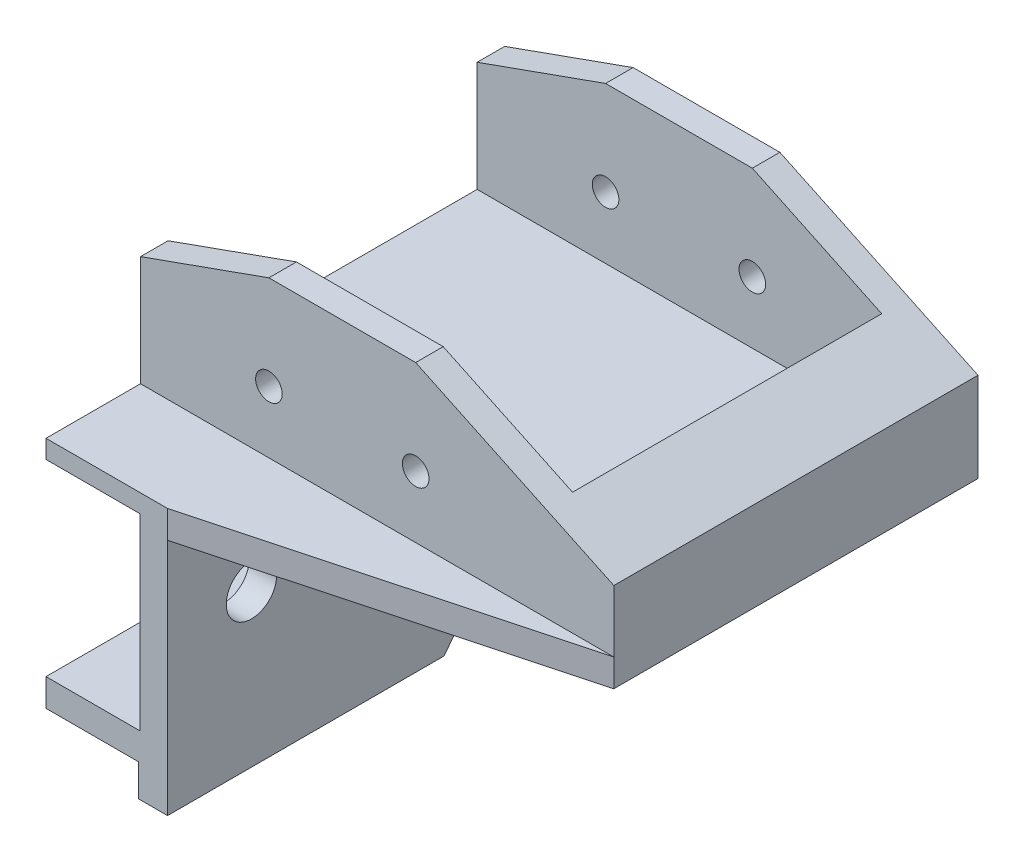
ISO-10303-21;
HEADER;
FILE_DESCRIPTION(('STEP AP214'),'2;1');
FILE_NAME('part.step','',(''),(''),'','','');
FILE_SCHEMA(('AUTOMOTIVE_DESIGN { 1 0 10303 214 1 1 1 1 }'));
ENDSEC;
DATA;
#1=APPLICATION_CONTEXT('core data for automotive mechanical design processes');
#2=APPLICATION_PROTOCOL_DEFINITION('international standard','automotive_design',2000,#1);
#3=PRODUCT_CONTEXT('',#1,'mechanical');
#4=PRODUCT('Part','Part','',(#3));
#5=PRODUCT_RELATED_PRODUCT_CATEGORY('part','',(#4));
#6=PRODUCT_DEFINITION_FORMATION('','',#4);
#7=PRODUCT_DEFINITION_CONTEXT('part definition',#1,'design');
#8=PRODUCT_DEFINITION('design','',#6,#7);
#9=PRODUCT_DEFINITION_SHAPE('','',#8);
#10=(LENGTH_UNIT() NAMED_UNIT(*) SI_UNIT(.MILLI.,.METRE.));
#11=(NAMED_UNIT(*) PLANE_ANGLE_UNIT() SI_UNIT($,.RADIAN.));
#12=(NAMED_UNIT(*) SI_UNIT($,.STERADIAN.) SOLID_ANGLE_UNIT());
#13=UNCERTAINTY_MEASURE_WITH_UNIT(LENGTH_MEASURE(1.E-05),#10,'distance_accuracy_value','');
#14=(GEOMETRIC_REPRESENTATION_CONTEXT(3) GLOBAL_UNCERTAINTY_ASSIGNED_CONTEXT((#13)) GLOBAL_UNIT_ASSIGNED_CONTEXT((#10,
#11,#12)) REPRESENTATION_CONTEXT('',''));
#15=CARTESIAN_POINT('',(0.,0.,0.));
#16=DIRECTION('',(0.,0.,1.));
#17=DIRECTION('',(1.,0.,0.));
#18=AXIS2_PLACEMENT_3D('',#15,#16,#17);
#19=CARTESIAN_POINT('',(-103.2,0.,39.7));
#20=DIRECTION('',(0.,0.,-1.));
#21=DIRECTION('',(1.,0.,0.));
#22=AXIS2_PLACEMENT_3D('',#19,#20,#21);
#23=PLANE('',#22);
#24=CARTESIAN_POINT('',(-21.6,9.75,39.7));
#25=DIRECTION('',(0.,0.,1.));
#26=DIRECTION('',(1.,0.,0.));
#27=AXIS2_PLACEMENT_3D('',#24,#25,#26);
#28=CIRCLE('',#27,1.44999999999999);
#29=CARTESIAN_POINT('',(-20.15,9.75,39.7));
#30=VERTEX_POINT('',#29);
#31=EDGE_CURVE('E306',#30,#30,#28,.T.);
#32=ORIENTED_EDGE('',*,*,#31,.F.);
#33=EDGE_LOOP('',(#32));
#34=FACE_BOUND('',#33,.T.);
#35=CARTESIAN_POINT('',(-37.6,9.75,39.7));
#36=DIRECTION('',(0.,0.,1.));
#37=DIRECTION('',(1.,0.,0.));
#38=AXIS2_PLACEMENT_3D('',#35,#36,#37);
#39=CIRCLE('',#38,1.44999999999999);
#40=CARTESIAN_POINT('',(-36.15,9.75,39.7));
#41=VERTEX_POINT('',#40);
#42=EDGE_CURVE('E293',#41,#41,#39,.T.);
#43=ORIENTED_EDGE('',*,*,#42,.F.);
#44=EDGE_LOOP('',(#43));
#45=FACE_BOUND('',#44,.T.);
#46=DIRECTION('',(1.,0.,0.));
#47=VECTOR('',#46,1.);
#48=CARTESIAN_POINT('',(-103.2,2.99999999999999,39.7));
#49=LINE('',#48,#47);
#50=CARTESIAN_POINT('',(-51.6,2.99999999999999,39.7));
#51=VERTEX_POINT('',#50);
#52=CARTESIAN_POINT('',(0.,3.00000000000001,39.7));
#53=VERTEX_POINT('',#52);
#54=EDGE_CURVE('E368',#51,#53,#49,.T.);
#55=ORIENTED_EDGE('',*,*,#54,.T.);
#56=DIRECTION('',(0.,-1.,0.));
#57=VECTOR('',#56,1.);
#58=CARTESIAN_POINT('',(0.,0.,39.7));
#59=LINE('',#58,#57);
#60=CARTESIAN_POINT('',(0.,9.75000000000002,39.7));
#61=VERTEX_POINT('',#60);
#62=EDGE_CURVE('E398',#61,#53,#59,.T.);
#63=ORIENTED_EDGE('',*,*,#62,.F.);
#64=DIRECTION('',(-0.903439539264527,0.428715522104693,0.));
#65=VECTOR('',#64,1.);
#66=CARTESIAN_POINT('',(-80.4557938149741,47.9292540094205,39.7));
#67=LINE('',#66,#65);
#68=CARTESIAN_POINT('',(-21.6,20.,39.7));
#69=VERTEX_POINT('',#68);
#70=EDGE_CURVE('E270',#61,#69,#67,.T.);
#71=ORIENTED_EDGE('',*,*,#70,.T.);
#72=DIRECTION('',(1.,0.,0.));
#73=VECTOR('',#72,1.);
#74=CARTESIAN_POINT('',(0.,20.,39.7));
#75=LINE('',#74,#73);
#76=CARTESIAN_POINT('',(-37.6,20.,39.7));
#77=VERTEX_POINT('',#76);
#78=EDGE_CURVE('E395',#77,#69,#75,.T.);
#79=ORIENTED_EDGE('',*,*,#78,.F.);
#80=DIRECTION('',(-0.941741911594838,-0.336336396998156,0.));
#81=VECTOR('',#80,1.);
#82=CARTESIAN_POINT('',(-102.114027149321,-3.04072398190047,39.7));
#83=LINE('',#82,#81);
#84=CARTESIAN_POINT('',(-51.6,15.,39.7));
#85=VERTEX_POINT('',#84);
#86=EDGE_CURVE('E262',#77,#85,#83,.T.);
#87=ORIENTED_EDGE('',*,*,#86,.T.);
#88=DIRECTION('',(0.,1.,0.));
#89=VECTOR('',#88,1.);
#90=CARTESIAN_POINT('',(-51.6,0.,39.7));
#91=LINE('',#90,#89);
#92=EDGE_CURVE('E242',#51,#85,#91,.T.);
#93=ORIENTED_EDGE('',*,*,#92,.F.);
#94=EDGE_LOOP('',(#55,#63,#71,#79,#87,#93));
#95=FACE_BOUND('',#94,.T.);
#96=ADVANCED_FACE('F43',(#34,#45,#95),#23,.F.);
#97=CARTESIAN_POINT('',(0.,20.,39.7));
#98=DIRECTION('',(0.,-1.,0.));
#99=DIRECTION('',(-1.,0.,0.));
#100=AXIS2_PLACEMENT_3D('',#97,#98,#99);
#101=PLANE('',#100);
#102=DIRECTION('',(0.,0.,-1.));
#103=VECTOR('',#102,1.);
#104=CARTESIAN_POINT('',(-21.6,20.,50.));
#105=LINE('',#104,#103);
#106=CARTESIAN_POINT('',(-21.6,20.,36.7));
#107=VERTEX_POINT('',#106);
#108=EDGE_CURVE('E253',#69,#107,#105,.T.);
#109=ORIENTED_EDGE('',*,*,#108,.T.);
#110=DIRECTION('',(-1.,0.,0.));
#111=VECTOR('',#110,1.);
#112=CARTESIAN_POINT('',(-7.50000000000005,20.,36.7));
#113=LINE('',#112,#111);
#114=CARTESIAN_POINT('',(-37.6,20.,36.7));
#115=VERTEX_POINT('',#114);
#116=EDGE_CURVE('E374',#107,#115,#113,.T.);
#117=ORIENTED_EDGE('',*,*,#116,.T.);
#118=DIRECTION('',(0.,0.,-1.));
#119=VECTOR('',#118,1.);
#120=CARTESIAN_POINT('',(-37.6,20.,50.));
#121=LINE('',#120,#119);
#122=EDGE_CURVE('E258',#77,#115,#121,.T.);
#123=ORIENTED_EDGE('',*,*,#122,.F.);
#124=ORIENTED_EDGE('',*,*,#78,.T.);
#125=EDGE_LOOP('',(#109,#117,#123,#124));
#126=FACE_BOUND('',#125,.T.);
#127=ADVANCED_FACE('F45',(#126),#101,.F.);
#128=CARTESIAN_POINT('',(-21.6,20.,3.));
#129=VERTEX_POINT('',#128);
#130=CARTESIAN_POINT('',(-21.6,20.,0.));
#131=VERTEX_POINT('',#130);
#132=EDGE_CURVE('E250',#129,#131,#105,.T.);
#133=ORIENTED_EDGE('',*,*,#132,.T.);
#134=DIRECTION('',(1.,0.,0.));
#135=VECTOR('',#134,1.);
#136=CARTESIAN_POINT('',(0.,20.,0.));
#137=LINE('',#136,#135);
#138=CARTESIAN_POINT('',(-37.6,20.,0.));
#139=VERTEX_POINT('',#138);
#140=EDGE_CURVE('E394',#139,#131,#137,.T.);
#141=ORIENTED_EDGE('',*,*,#140,.F.);
#142=CARTESIAN_POINT('',(-37.6,20.,3.));
#143=VERTEX_POINT('',#142);
#144=EDGE_CURVE('E245',#143,#139,#121,.T.);
#145=ORIENTED_EDGE('',*,*,#144,.F.);
#146=DIRECTION('',(1.,0.,0.));
#147=VECTOR('',#146,1.);
#148=CARTESIAN_POINT('',(-7.50000000000005,20.,3.));
#149=LINE('',#148,#147);
#150=EDGE_CURVE('E385',#143,#129,#149,.T.);
#151=ORIENTED_EDGE('',*,*,#150,.T.);
#152=EDGE_LOOP('',(#133,#141,#145,#151));
#153=FACE_BOUND('',#152,.T.);
#154=ADVANCED_FACE('F441',(#153),#101,.F.);
#155=CARTESIAN_POINT('',(0.,0.,39.7));
#156=DIRECTION('',(-1.,0.,0.));
#157=DIRECTION('',(0.,0.,-1.));
#158=AXIS2_PLACEMENT_3D('',#155,#156,#157);
#159=PLANE('',#158);
#160=DIRECTION('',(0.,0.,-1.));
#161=VECTOR('',#160,1.);
#162=CARTESIAN_POINT('',(0.,9.75000000000002,50.));
#163=LINE('',#162,#161);
#164=CARTESIAN_POINT('',(0.,9.75000000000002,0.));
#165=VERTEX_POINT('',#164);
#166=EDGE_CURVE('E248',#61,#165,#163,.T.);
#167=ORIENTED_EDGE('',*,*,#166,.F.);
#168=ORIENTED_EDGE('',*,*,#62,.T.);
#169=DIRECTION('',(0.,-1.,0.));
#170=VECTOR('',#169,1.);
#171=CARTESIAN_POINT('',(0.,42.709098453629,39.7));
#172=LINE('',#171,#170);
#173=CARTESIAN_POINT('',(0.,0.,39.7));
#174=VERTEX_POINT('',#173);
#175=EDGE_CURVE('E312',#53,#174,#172,.T.);
#176=ORIENTED_EDGE('',*,*,#175,.T.);
#177=DIRECTION('',(0.,0.,-1.));
#178=VECTOR('',#177,1.);
#179=CARTESIAN_POINT('',(0.,0.,39.7));
#180=LINE('',#179,#178);
#181=CARTESIAN_POINT('',(0.,0.,0.));
#182=VERTEX_POINT('',#181);
#183=EDGE_CURVE('E401',#174,#182,#180,.T.);
#184=ORIENTED_EDGE('',*,*,#183,.T.);
#185=DIRECTION('',(0.,-1.,0.));
#186=VECTOR('',#185,1.);
#187=CARTESIAN_POINT('',(0.,0.,0.));
#188=LINE('',#187,#186);
#189=EDGE_CURVE('E404',#165,#182,#188,.T.);
#190=ORIENTED_EDGE('',*,*,#189,.F.);
#191=EDGE_LOOP('',(#167,#168,#176,#184,#190));
#192=FACE_BOUND('',#191,.T.);
#193=ADVANCED_FACE('F434',(#192),#159,.F.);
#194=CARTESIAN_POINT('',(-103.2,0.,0.));
#195=DIRECTION('',(0.,0.,-1.));
#196=DIRECTION('',(1.,0.,0.));
#197=AXIS2_PLACEMENT_3D('',#194,#195,#196);
#198=PLANE('',#197);
#199=DIRECTION('',(0.,-1.,0.));
#200=VECTOR('',#199,1.);
#201=CARTESIAN_POINT('',(-51.6,20.,0.));
#202=LINE('',#201,#200);
#203=CARTESIAN_POINT('',(-51.6,15.,0.));
#204=VERTEX_POINT('',#203);
#205=CARTESIAN_POINT('',(-51.6,0.,0.));
#206=VERTEX_POINT('',#205);
#207=EDGE_CURVE('E211',#204,#206,#202,.T.);
#208=ORIENTED_EDGE('',*,*,#207,.F.);
#209=DIRECTION('',(-0.941741911594837,-0.336336396998156,0.));
#210=VECTOR('',#209,1.);
#211=CARTESIAN_POINT('',(-37.6,20.,0.));
#212=LINE('',#211,#210);
#213=EDGE_CURVE('E249',#139,#204,#212,.T.);
#214=ORIENTED_EDGE('',*,*,#213,.F.);
#215=ORIENTED_EDGE('',*,*,#140,.T.);
#216=DIRECTION('',(-0.903439539264527,0.428715522104693,0.));
#217=VECTOR('',#216,1.);
#218=CARTESIAN_POINT('',(-80.4557938149741,47.9292540094205,0.));
#219=LINE('',#218,#217);
#220=EDGE_CURVE('E246',#165,#131,#219,.T.);
#221=ORIENTED_EDGE('',*,*,#220,.F.);
#222=ORIENTED_EDGE('',*,*,#189,.T.);
#223=DIRECTION('',(-1.,0.,0.));
#224=VECTOR('',#223,1.);
#225=CARTESIAN_POINT('',(-103.2,0.,0.));
#226=LINE('',#225,#224);
#227=CARTESIAN_POINT('',(-38.35,0.,0.));
#228=VERTEX_POINT('',#227);
#229=EDGE_CURVE('E213',#182,#228,#226,.T.);
#230=ORIENTED_EDGE('',*,*,#229,.T.);
#231=DIRECTION('',(-1.,0.,0.));
#232=VECTOR('',#231,1.);
#233=CARTESIAN_POINT('',(0.,0.,0.));
#234=LINE('',#233,#232);
#235=EDGE_CURVE('E197',#228,#206,#234,.T.);
#236=ORIENTED_EDGE('',*,*,#235,.T.);
#237=EDGE_LOOP('',(#208,#214,#215,#221,#222,#230,#236));
#238=FACE_BOUND('',#237,.T.);
#239=CARTESIAN_POINT('',(-37.6,9.75,0.));
#240=DIRECTION('',(0.,0.,1.));
#241=DIRECTION('',(1.,0.,0.));
#242=AXIS2_PLACEMENT_3D('',#239,#240,#241);
#243=CIRCLE('',#242,1.475);
#244=CARTESIAN_POINT('',(-36.125,9.75,0.));
#245=VERTEX_POINT('',#244);
#246=EDGE_CURVE('E283',#245,#245,#243,.T.);
#247=ORIENTED_EDGE('',*,*,#246,.T.);
#248=EDGE_LOOP('',(#247));
#249=FACE_BOUND('',#248,.T.);
#250=CARTESIAN_POINT('',(-21.6,9.75,0.));
#251=DIRECTION('',(0.,0.,1.));
#252=DIRECTION('',(1.,0.,0.));
#253=AXIS2_PLACEMENT_3D('',#250,#251,#252);
#254=CIRCLE('',#253,1.475);
#255=CARTESIAN_POINT('',(-20.125,9.75,0.));
#256=VERTEX_POINT('',#255);
#257=EDGE_CURVE('E296',#256,#256,#254,.T.);
#258=ORIENTED_EDGE('',*,*,#257,.T.);
#259=EDGE_LOOP('',(#258));
#260=FACE_BOUND('',#259,.T.);
#261=ADVANCED_FACE('F209',(#238,#249,#260),#198,.T.);
#262=CARTESIAN_POINT('',(-7.50000000000002,-94.4189070049002,3.));
#263=DIRECTION('',(1.,0.,0.));
#264=DIRECTION('',(0.,0.,1.));
#265=AXIS2_PLACEMENT_3D('',#262,#263,#264);
#266=PLANE('',#265);
#267=DIRECTION('',(0.,0.,-1.));
#268=VECTOR('',#267,1.);
#269=CARTESIAN_POINT('',(-7.50000000000005,13.3090277777778,3.));
#270=LINE('',#269,#268);
#271=CARTESIAN_POINT('',(-7.50000000000005,13.3090277777778,36.7));
#272=VERTEX_POINT('',#271);
#273=CARTESIAN_POINT('',(-7.50000000000005,13.3090277777778,3.));
#274=VERTEX_POINT('',#273);
#275=EDGE_CURVE('E265',#272,#274,#270,.T.);
#276=ORIENTED_EDGE('',*,*,#275,.T.);
#277=DIRECTION('',(0.,1.,0.));
#278=VECTOR('',#277,1.);
#279=CARTESIAN_POINT('',(-7.50000000000002,-94.4189070049002,3.));
#280=LINE('',#279,#278);
#281=CARTESIAN_POINT('',(-7.50000000000005,3.,3.));
#282=VERTEX_POINT('',#281);
#283=EDGE_CURVE('E379',#282,#274,#280,.T.);
#284=ORIENTED_EDGE('',*,*,#283,.F.);
#285=DIRECTION('',(0.,0.,-1.));
#286=VECTOR('',#285,1.);
#287=CARTESIAN_POINT('',(-7.50000000000005,3.,3.));
#288=LINE('',#287,#286);
#289=CARTESIAN_POINT('',(-7.50000000000005,3.,36.7));
#290=VERTEX_POINT('',#289);
#291=EDGE_CURVE('E378',#290,#282,#288,.T.);
#292=ORIENTED_EDGE('',*,*,#291,.F.);
#293=DIRECTION('',(0.,1.,0.));
#294=VECTOR('',#293,1.);
#295=CARTESIAN_POINT('',(-7.50000000000002,-94.4189070049002,36.7));
#296=LINE('',#295,#294);
#297=EDGE_CURVE('E388',#290,#272,#296,.T.);
#298=ORIENTED_EDGE('',*,*,#297,.T.);
#299=EDGE_LOOP('',(#276,#284,#292,#298));
#300=FACE_BOUND('',#299,.T.);
#301=ADVANCED_FACE('F449',(#300),#266,.F.);
#302=CARTESIAN_POINT('',(-7.50000000000002,-94.4189070049002,3.));
#303=DIRECTION('',(0.,0.,-1.));
#304=DIRECTION('',(1.,0.,0.));
#305=AXIS2_PLACEMENT_3D('',#302,#303,#304);
#306=PLANE('',#305);
#307=CARTESIAN_POINT('',(-21.6,9.75,3.));
#308=DIRECTION('',(0.,0.,1.));
#309=DIRECTION('',(1.,0.,0.));
#310=AXIS2_PLACEMENT_3D('',#307,#308,#309);
#311=CIRCLE('',#310,1.44999999999999);
#312=CARTESIAN_POINT('',(-20.15,9.75,3.));
#313=VERTEX_POINT('',#312);
#314=EDGE_CURVE('E302',#313,#313,#311,.T.);
#315=ORIENTED_EDGE('',*,*,#314,.F.);
#316=EDGE_LOOP('',(#315));
#317=FACE_BOUND('',#316,.T.);
#318=CARTESIAN_POINT('',(-37.6,9.75,3.));
#319=DIRECTION('',(0.,0.,1.));
#320=DIRECTION('',(1.,0.,0.));
#321=AXIS2_PLACEMENT_3D('',#318,#319,#320);
#322=CIRCLE('',#321,1.44999999999999);
#323=CARTESIAN_POINT('',(-36.15,9.75,3.));
#324=VERTEX_POINT('',#323);
#325=EDGE_CURVE('E289',#324,#324,#322,.T.);
#326=ORIENTED_EDGE('',*,*,#325,.F.);
#327=EDGE_LOOP('',(#326));
#328=FACE_BOUND('',#327,.T.);
#329=DIRECTION('',(-1.,0.,0.));
#330=VECTOR('',#329,1.);
#331=CARTESIAN_POINT('',(-7.50000000000003,3.,3.));
#332=LINE('',#331,#330);
#333=CARTESIAN_POINT('',(-51.6,2.99999999999999,3.));
#334=VERTEX_POINT('',#333);
#335=EDGE_CURVE('E375',#282,#334,#332,.T.);
#336=ORIENTED_EDGE('',*,*,#335,.F.);
#337=ORIENTED_EDGE('',*,*,#283,.T.);
#338=DIRECTION('',(-0.903439539264527,0.428715522104693,0.));
#339=VECTOR('',#338,1.);
#340=CARTESIAN_POINT('',(34.2250279002049,-6.49104333227308,3.00000000000001));
#341=LINE('',#340,#339);
#342=EDGE_CURVE('E268',#274,#129,#341,.T.);
#343=ORIENTED_EDGE('',*,*,#342,.T.);
#344=ORIENTED_EDGE('',*,*,#150,.F.);
#345=DIRECTION('',(-0.941741911594838,-0.336336396998156,0.));
#346=VECTOR('',#345,1.);
#347=CARTESIAN_POINT('',(-47.1462601372987,16.5906213795362,3.));
#348=LINE('',#347,#346);
#349=CARTESIAN_POINT('',(-51.6,15.,3.));
#350=VERTEX_POINT('',#349);
#351=EDGE_CURVE('E58',#143,#350,#348,.T.);
#352=ORIENTED_EDGE('',*,*,#351,.T.);
#353=DIRECTION('',(0.,1.,0.));
#354=VECTOR('',#353,1.);
#355=CARTESIAN_POINT('',(-51.6,-94.4189070049002,3.));
#356=LINE('',#355,#354);
#357=EDGE_CURVE('E226',#334,#350,#356,.T.);
#358=ORIENTED_EDGE('',*,*,#357,.F.);
#359=EDGE_LOOP('',(#336,#337,#343,#344,#352,#358));
#360=FACE_BOUND('',#359,.T.);
#361=ADVANCED_FACE('F444',(#317,#328,#360),#306,.F.);
#362=CARTESIAN_POINT('',(-7.50000000000002,-94.4189070049002,36.7));
#363=DIRECTION('',(0.,0.,1.));
#364=DIRECTION('',(-1.,0.,0.));
#365=AXIS2_PLACEMENT_3D('',#362,#363,#364);
#366=PLANE('',#365);
#367=CARTESIAN_POINT('',(-21.6,9.75,36.7));
#368=DIRECTION('',(0.,0.,-1.));
#369=DIRECTION('',(-1.,0.,0.));
#370=AXIS2_PLACEMENT_3D('',#367,#368,#369);
#371=CIRCLE('',#370,1.44999999999999);
#372=CARTESIAN_POINT('',(-23.05,9.75,36.7));
#373=VERTEX_POINT('',#372);
#374=EDGE_CURVE('E303',#373,#373,#371,.T.);
#375=ORIENTED_EDGE('',*,*,#374,.F.);
#376=EDGE_LOOP('',(#375));
#377=FACE_BOUND('',#376,.T.);
#378=CARTESIAN_POINT('',(-37.6,9.75,36.7));
#379=DIRECTION('',(0.,0.,-1.));
#380=DIRECTION('',(-1.,0.,0.));
#381=AXIS2_PLACEMENT_3D('',#378,#379,#380);
#382=CIRCLE('',#381,1.44999999999999);
#383=CARTESIAN_POINT('',(-39.05,9.75,36.7));
#384=VERTEX_POINT('',#383);
#385=EDGE_CURVE('E290',#384,#384,#382,.T.);
#386=ORIENTED_EDGE('',*,*,#385,.F.);
#387=EDGE_LOOP('',(#386));
#388=FACE_BOUND('',#387,.T.);
#389=DIRECTION('',(0.941741911594838,0.336336396998156,0.));
#390=VECTOR('',#389,1.);
#391=CARTESIAN_POINT('',(-47.1462601372987,16.5906213795362,36.7));
#392=LINE('',#391,#390);
#393=CARTESIAN_POINT('',(-51.6,15.,36.7));
#394=VERTEX_POINT('',#393);
#395=EDGE_CURVE('E51',#394,#115,#392,.T.);
#396=ORIENTED_EDGE('',*,*,#395,.T.);
#397=ORIENTED_EDGE('',*,*,#116,.F.);
#398=DIRECTION('',(0.903439539264527,-0.428715522104693,0.));
#399=VECTOR('',#398,1.);
#400=CARTESIAN_POINT('',(34.2250279002049,-6.49104333227308,36.7));
#401=LINE('',#400,#399);
#402=EDGE_CURVE('E12',#107,#272,#401,.T.);
#403=ORIENTED_EDGE('',*,*,#402,.T.);
#404=ORIENTED_EDGE('',*,*,#297,.F.);
#405=DIRECTION('',(1.,0.,0.));
#406=VECTOR('',#405,1.);
#407=CARTESIAN_POINT('',(-7.50000000000003,3.,36.7));
#408=LINE('',#407,#406);
#409=CARTESIAN_POINT('',(-51.6,2.99999999999999,36.7));
#410=VERTEX_POINT('',#409);
#411=EDGE_CURVE('E382',#410,#290,#408,.T.);
#412=ORIENTED_EDGE('',*,*,#411,.F.);
#413=DIRECTION('',(0.,-1.,0.));
#414=VECTOR('',#413,1.);
#415=CARTESIAN_POINT('',(-51.6,-94.4189070049002,36.7));
#416=LINE('',#415,#414);
#417=EDGE_CURVE('E205',#394,#410,#416,.T.);
#418=ORIENTED_EDGE('',*,*,#417,.F.);
#419=EDGE_LOOP('',(#396,#397,#403,#404,#412,#418));
#420=FACE_BOUND('',#419,.T.);
#421=ADVANCED_FACE('F419',(#377,#388,#420),#366,.F.);
#422=CARTESIAN_POINT('',(-103.2,-26.,0.));
#423=DIRECTION('',(0.,-1.,0.));
#424=DIRECTION('',(-1.,0.,0.));
#425=AXIS2_PLACEMENT_3D('',#422,#423,#424);
#426=PLANE('',#425);
#427=DIRECTION('',(-1.,0.,0.));
#428=VECTOR('',#427,1.);
#429=CARTESIAN_POINT('',(0.,-26.,19.85));
#430=LINE('',#429,#428);
#431=CARTESIAN_POINT('',(-38.35,-26.,19.85));
#432=VERTEX_POINT('',#431);
#433=CARTESIAN_POINT('',(-41.5,-26.,19.85));
#434=VERTEX_POINT('',#433);
#435=EDGE_CURVE('E215',#432,#434,#430,.T.);
#436=ORIENTED_EDGE('',*,*,#435,.F.);
#437=DIRECTION('',(0.,0.,-1.));
#438=VECTOR('',#437,1.);
#439=CARTESIAN_POINT('',(-38.35,-26.,0.));
#440=LINE('',#439,#438);
#441=CARTESIAN_POINT('',(-38.35,-26.,50.));
#442=VERTEX_POINT('',#441);
#443=EDGE_CURVE('E360',#442,#432,#440,.T.);
#444=ORIENTED_EDGE('',*,*,#443,.F.);
#445=DIRECTION('',(1.,0.,0.));
#446=VECTOR('',#445,1.);
#447=CARTESIAN_POINT('',(-38.35,-26.,50.));
#448=LINE('',#447,#446);
#449=CARTESIAN_POINT('',(-41.5,-26.,50.));
#450=VERTEX_POINT('',#449);
#451=EDGE_CURVE('E357',#450,#442,#448,.T.);
#452=ORIENTED_EDGE('',*,*,#451,.F.);
#453=DIRECTION('',(0.,0.,-1.));
#454=VECTOR('',#453,1.);
#455=CARTESIAN_POINT('',(-41.5,-26.,0.));
#456=LINE('',#455,#454);
#457=EDGE_CURVE('E324',#450,#434,#456,.T.);
#458=ORIENTED_EDGE('',*,*,#457,.T.);
#459=EDGE_LOOP('',(#436,#444,#452,#458));
#460=FACE_BOUND('',#459,.T.);
#461=ADVANCED_FACE('F469',(#460),#426,.T.);
#462=CARTESIAN_POINT('',(-103.2,0.,39.7));
#463=DIRECTION('',(0.,1.,0.));
#464=DIRECTION('',(1.,0.,0.));
#465=AXIS2_PLACEMENT_3D('',#462,#463,#464);
#466=PLANE('',#465);
#467=DIRECTION('',(0.,0.,-1.));
#468=VECTOR('',#467,1.);
#469=CARTESIAN_POINT('',(-38.35,0.,39.7));
#470=LINE('',#469,#468);
#471=CARTESIAN_POINT('',(-38.35,0.,50.));
#472=VERTEX_POINT('',#471);
#473=EDGE_CURVE('E371',#472,#228,#470,.T.);
#474=ORIENTED_EDGE('',*,*,#473,.T.);
#475=ORIENTED_EDGE('',*,*,#229,.F.);
#476=ORIENTED_EDGE('',*,*,#183,.F.);
#477=DIRECTION('',(0.965773626031422,0.,-0.259386397604267));
#478=VECTOR('',#477,1.);
#479=CARTESIAN_POINT('',(-38.35,0.,50.));
#480=LINE('',#479,#478);
#481=EDGE_CURVE('E315',#472,#174,#480,.T.);
#482=ORIENTED_EDGE('',*,*,#481,.F.);
#483=EDGE_LOOP('',(#474,#475,#476,#482));
#484=FACE_BOUND('',#483,.T.);
#485=ADVANCED_FACE('F462',(#484),#466,.F.);
#486=CARTESIAN_POINT('',(-103.2,2.99999999999999,39.7));
#487=DIRECTION('',(0.,1.,0.));
#488=DIRECTION('',(1.,0.,0.));
#489=AXIS2_PLACEMENT_3D('',#486,#487,#488);
#490=PLANE('',#489);
#491=DIRECTION('',(0.,0.,1.));
#492=VECTOR('',#491,1.);
#493=CARTESIAN_POINT('',(-51.6,2.99999999999999,39.7));
#494=LINE('',#493,#492);
#495=EDGE_CURVE('E228',#334,#410,#494,.T.);
#496=ORIENTED_EDGE('',*,*,#495,.T.);
#497=ORIENTED_EDGE('',*,*,#411,.T.);
#498=ORIENTED_EDGE('',*,*,#291,.T.);
#499=ORIENTED_EDGE('',*,*,#335,.T.);
#500=EDGE_LOOP('',(#496,#497,#498,#499));
#501=FACE_BOUND('',#500,.T.);
#502=ADVANCED_FACE('F452',(#501),#490,.T.);
#503=CARTESIAN_POINT('',(-38.35,-26.,0.));
#504=DIRECTION('',(-1.,0.,0.));
#505=DIRECTION('',(0.,1.,0.));
#506=AXIS2_PLACEMENT_3D('',#503,#504,#505);
#507=PLANE('',#506);
#508=CARTESIAN_POINT('',(-38.35,-9.24999999999995,25.85));
#509=DIRECTION('',(1.,0.,0.));
#510=DIRECTION('',(0.,1.,0.));
#511=AXIS2_PLACEMENT_3D('',#508,#509,#510);
#512=CIRCLE('',#511,2.74999999999999);
#513=CARTESIAN_POINT('',(-38.35,-6.49999999999996,25.85));
#514=VERTEX_POINT('',#513);
#515=EDGE_CURVE('E274',#514,#514,#512,.T.);
#516=ORIENTED_EDGE('',*,*,#515,.F.);
#517=EDGE_LOOP('',(#516));
#518=FACE_BOUND('',#517,.T.);
#519=CARTESIAN_POINT('',(-38.35,-9.24999999999995,40.85));
#520=DIRECTION('',(1.,0.,0.));
#521=DIRECTION('',(0.,1.,0.));
#522=AXIS2_PLACEMENT_3D('',#519,#520,#521);
#523=CIRCLE('',#522,2.74999999999999);
#524=CARTESIAN_POINT('',(-38.35,-6.49999999999996,40.85));
#525=VERTEX_POINT('',#524);
#526=EDGE_CURVE('E277',#525,#525,#523,.T.);
#527=ORIENTED_EDGE('',*,*,#526,.F.);
#528=EDGE_LOOP('',(#527));
#529=FACE_BOUND('',#528,.T.);
#530=DIRECTION('',(0.,1.,0.));
#531=VECTOR('',#530,1.);
#532=CARTESIAN_POINT('',(-38.35,-26.,50.));
#533=LINE('',#532,#531);
#534=EDGE_CURVE('E363',#442,#472,#533,.T.);
#535=ORIENTED_EDGE('',*,*,#534,.F.);
#536=ORIENTED_EDGE('',*,*,#443,.T.);
#537=DIRECTION('',(0.,-0.794834835806078,0.606825826567332));
#538=VECTOR('',#537,1.);
#539=CARTESIAN_POINT('',(-38.35,-16.4258228214827,12.5404839617859));
#540=LINE('',#539,#538);
#541=EDGE_CURVE('E322',#228,#432,#540,.T.);
#542=ORIENTED_EDGE('',*,*,#541,.F.);
#543=ORIENTED_EDGE('',*,*,#473,.F.);
#544=EDGE_LOOP('',(#535,#536,#542,#543));
#545=FACE_BOUND('',#544,.T.);
#546=ADVANCED_FACE('F464',(#518,#529,#545),#507,.F.);
#547=CARTESIAN_POINT('',(-103.2,2.99999999999999,0.));
#548=DIRECTION('',(0.,-1.,0.));
#549=DIRECTION('',(-1.,0.,0.));
#550=AXIS2_PLACEMENT_3D('',#547,#548,#549);
#551=PLANE('',#550);
#552=DIRECTION('',(1.,0.,0.));
#553=VECTOR('',#552,1.);
#554=CARTESIAN_POINT('',(-38.35,3.,50.));
#555=LINE('',#554,#553);
#556=CARTESIAN_POINT('',(-51.6,3.,50.));
#557=VERTEX_POINT('',#556);
#558=CARTESIAN_POINT('',(-38.35,3.,50.));
#559=VERTEX_POINT('',#558);
#560=EDGE_CURVE('E356',#557,#559,#555,.T.);
#561=ORIENTED_EDGE('',*,*,#560,.T.);
#562=DIRECTION('',(-0.965773626031422,0.,0.259386397604267));
#563=VECTOR('',#562,1.);
#564=CARTESIAN_POINT('',(-38.35,3.,50.));
#565=LINE('',#564,#563);
#566=EDGE_CURVE('E309',#53,#559,#565,.T.);
#567=ORIENTED_EDGE('',*,*,#566,.F.);
#568=ORIENTED_EDGE('',*,*,#54,.F.);
#569=DIRECTION('',(0.,0.,-1.));
#570=VECTOR('',#569,1.);
#571=CARTESIAN_POINT('',(-51.6,2.99999999999999,0.));
#572=LINE('',#571,#570);
#573=EDGE_CURVE('E240',#557,#51,#572,.T.);
#574=ORIENTED_EDGE('',*,*,#573,.F.);
#575=EDGE_LOOP('',(#561,#567,#568,#574));
#576=FACE_BOUND('',#575,.T.);
#577=ADVANCED_FACE('F455',(#576),#551,.F.);
#578=CARTESIAN_POINT('',(-38.35,-26.,50.));
#579=DIRECTION('',(0.,0.,-1.));
#580=DIRECTION('',(1.,0.,0.));
#581=AXIS2_PLACEMENT_3D('',#578,#579,#580);
#582=PLANE('',#581);
#583=DIRECTION('',(-1.,0.,0.));
#584=VECTOR('',#583,1.);
#585=CARTESIAN_POINT('',(-41.5,-22.5,50.));
#586=LINE('',#585,#584);
#587=CARTESIAN_POINT('',(-41.5,-22.5,50.));
#588=VERTEX_POINT('',#587);
#589=CARTESIAN_POINT('',(-51.6,-22.5,50.));
#590=VERTEX_POINT('',#589);
#591=EDGE_CURVE('E325',#588,#590,#586,.T.);
#592=ORIENTED_EDGE('',*,*,#591,.F.);
#593=DIRECTION('',(0.,-1.,0.));
#594=VECTOR('',#593,1.);
#595=CARTESIAN_POINT('',(-41.5,34.4262459290465,50.));
#596=LINE('',#595,#594);
#597=EDGE_CURVE('E329',#588,#450,#596,.T.);
#598=ORIENTED_EDGE('',*,*,#597,.T.);
#599=ORIENTED_EDGE('',*,*,#451,.T.);
#600=ORIENTED_EDGE('',*,*,#534,.T.);
#601=DIRECTION('',(0.,-1.,0.));
#602=VECTOR('',#601,1.);
#603=CARTESIAN_POINT('',(-38.35,42.709098453629,50.));
#604=LINE('',#603,#602);
#605=EDGE_CURVE('E313',#559,#472,#604,.T.);
#606=ORIENTED_EDGE('',*,*,#605,.F.);
#607=ORIENTED_EDGE('',*,*,#560,.F.);
#608=DIRECTION('',(0.,1.,0.));
#609=VECTOR('',#608,1.);
#610=CARTESIAN_POINT('',(-51.6,20.,50.));
#611=LINE('',#610,#609);
#612=CARTESIAN_POINT('',(-51.6,0.999999999999994,50.));
#613=VERTEX_POINT('',#612);
#614=EDGE_CURVE('E221',#613,#557,#611,.T.);
#615=ORIENTED_EDGE('',*,*,#614,.F.);
#616=DIRECTION('',(1.,0.,0.));
#617=VECTOR('',#616,1.);
#618=CARTESIAN_POINT('',(-41.35,0.999999999999995,50.));
#619=LINE('',#618,#617);
#620=CARTESIAN_POINT('',(-41.35,0.999999999999993,50.));
#621=VERTEX_POINT('',#620);
#622=EDGE_CURVE('E335',#613,#621,#619,.T.);
#623=ORIENTED_EDGE('',*,*,#622,.T.);
#624=DIRECTION('',(0.,-1.,0.));
#625=VECTOR('',#624,1.);
#626=CARTESIAN_POINT('',(-41.35,0.999999999999995,50.));
#627=LINE('',#626,#625);
#628=CARTESIAN_POINT('',(-41.35,-19.5,50.));
#629=VERTEX_POINT('',#628);
#630=EDGE_CURVE('E331',#621,#629,#627,.T.);
#631=ORIENTED_EDGE('',*,*,#630,.T.);
#632=DIRECTION('',(-1.,0.,0.));
#633=VECTOR('',#632,1.);
#634=CARTESIAN_POINT('',(-41.35,-19.5,50.));
#635=LINE('',#634,#633);
#636=CARTESIAN_POINT('',(-51.6,-19.5,50.));
#637=VERTEX_POINT('',#636);
#638=EDGE_CURVE('E339',#629,#637,#635,.T.);
#639=ORIENTED_EDGE('',*,*,#638,.T.);
#640=EDGE_CURVE('E223',#590,#637,#611,.T.);
#641=ORIENTED_EDGE('',*,*,#640,.F.);
#642=EDGE_LOOP('',(#592,#598,#599,#600,#606,#607,#615,#623,#631,#639,#641));
#643=FACE_BOUND('',#642,.T.);
#644=ADVANCED_FACE('F481',(#643),#582,.F.);
#645=CARTESIAN_POINT('',(-103.2,0.,19.85));
#646=DIRECTION('',(0.,0.,-1.));
#647=DIRECTION('',(1.,0.,0.));
#648=AXIS2_PLACEMENT_3D('',#645,#646,#647);
#649=PLANE('',#648);
#650=DIRECTION('',(-1.,0.,0.));
#651=VECTOR('',#650,1.);
#652=CARTESIAN_POINT('',(-41.35,-19.5,19.85));
#653=LINE('',#652,#651);
#654=CARTESIAN_POINT('',(-41.35,-19.5,19.85));
#655=VERTEX_POINT('',#654);
#656=CARTESIAN_POINT('',(-51.6,-19.5,19.85));
#657=VERTEX_POINT('',#656);
#658=EDGE_CURVE('E338',#655,#657,#653,.T.);
#659=ORIENTED_EDGE('',*,*,#658,.F.);
#660=DIRECTION('',(0.,-1.,0.));
#661=VECTOR('',#660,1.);
#662=CARTESIAN_POINT('',(-41.35,0.999999999999995,19.85));
#663=LINE('',#662,#661);
#664=CARTESIAN_POINT('',(-41.35,0.999999999999995,19.85));
#665=VERTEX_POINT('',#664);
#666=EDGE_CURVE('E347',#665,#655,#663,.T.);
#667=ORIENTED_EDGE('',*,*,#666,.F.);
#668=DIRECTION('',(1.,0.,0.));
#669=VECTOR('',#668,1.);
#670=CARTESIAN_POINT('',(-41.35,0.999999999999995,19.85));
#671=LINE('',#670,#669);
#672=CARTESIAN_POINT('',(-51.6,0.999999999999992,19.85));
#673=VERTEX_POINT('',#672);
#674=EDGE_CURVE('E346',#673,#665,#671,.T.);
#675=ORIENTED_EDGE('',*,*,#674,.F.);
#676=DIRECTION('',(0.,1.,0.));
#677=VECTOR('',#676,1.);
#678=CARTESIAN_POINT('',(-51.6,0.,19.85));
#679=LINE('',#678,#677);
#680=EDGE_CURVE('E235',#657,#673,#679,.T.);
#681=ORIENTED_EDGE('',*,*,#680,.F.);
#682=EDGE_LOOP('',(#659,#667,#675,#681));
#683=FACE_BOUND('',#682,.T.);
#684=ADVANCED_FACE('F490',(#683),#649,.F.);
#685=CARTESIAN_POINT('',(-41.35,-19.5,-28.9913780286485));
#686=DIRECTION('',(0.,-1.,0.));
#687=DIRECTION('',(0.,0.,-1.));
#688=AXIS2_PLACEMENT_3D('',#685,#686,#687);
#689=PLANE('',#688);
#690=ORIENTED_EDGE('',*,*,#638,.F.);
#691=DIRECTION('',(0.,0.,1.));
#692=VECTOR('',#691,1.);
#693=CARTESIAN_POINT('',(-41.35,-19.5,-28.9913780286485));
#694=LINE('',#693,#692);
#695=EDGE_CURVE('E350',#655,#629,#694,.T.);
#696=ORIENTED_EDGE('',*,*,#695,.F.);
#697=ORIENTED_EDGE('',*,*,#658,.T.);
#698=DIRECTION('',(0.,0.,-1.));
#699=VECTOR('',#698,1.);
#700=CARTESIAN_POINT('',(-51.6,-19.5,-28.9913780286485));
#701=LINE('',#700,#699);
#702=EDGE_CURVE('E238',#637,#657,#701,.T.);
#703=ORIENTED_EDGE('',*,*,#702,.F.);
#704=EDGE_LOOP('',(#690,#696,#697,#703));
#705=FACE_BOUND('',#704,.T.);
#706=ADVANCED_FACE('F485',(#705),#689,.F.);
#707=CARTESIAN_POINT('',(-41.35,0.999999999999995,-28.9913780286485));
#708=DIRECTION('',(0.,1.,0.));
#709=DIRECTION('',(0.,0.,1.));
#710=AXIS2_PLACEMENT_3D('',#707,#708,#709);
#711=PLANE('',#710);
#712=ORIENTED_EDGE('',*,*,#674,.T.);
#713=DIRECTION('',(0.,0.,1.));
#714=VECTOR('',#713,1.);
#715=CARTESIAN_POINT('',(-41.35,0.999999999999995,-28.9913780286485));
#716=LINE('',#715,#714);
#717=EDGE_CURVE('E351',#665,#621,#716,.T.);
#718=ORIENTED_EDGE('',*,*,#717,.T.);
#719=ORIENTED_EDGE('',*,*,#622,.F.);
#720=DIRECTION('',(0.,0.,1.));
#721=VECTOR('',#720,1.);
#722=CARTESIAN_POINT('',(-51.6,0.999999999999992,-28.9913780286485));
#723=LINE('',#722,#721);
#724=EDGE_CURVE('E233',#673,#613,#723,.T.);
#725=ORIENTED_EDGE('',*,*,#724,.F.);
#726=EDGE_LOOP('',(#712,#718,#719,#725));
#727=FACE_BOUND('',#726,.T.);
#728=ADVANCED_FACE('F493',(#727),#711,.F.);
#729=CARTESIAN_POINT('',(-41.35,0.999999999999995,-28.9913780286485));
#730=DIRECTION('',(1.,0.,0.));
#731=DIRECTION('',(0.,-1.,0.));
#732=AXIS2_PLACEMENT_3D('',#729,#730,#731);
#733=PLANE('',#732);
#734=CARTESIAN_POINT('',(-41.35,-9.24999999999995,25.85));
#735=DIRECTION('',(-1.,0.,0.));
#736=DIRECTION('',(0.,-1.,0.));
#737=AXIS2_PLACEMENT_3D('',#734,#735,#736);
#738=CIRCLE('',#737,2.74999999999999);
#739=CARTESIAN_POINT('',(-41.35,-11.9999999999999,25.85));
#740=VERTEX_POINT('',#739);
#741=EDGE_CURVE('E273',#740,#740,#738,.T.);
#742=ORIENTED_EDGE('',*,*,#741,.F.);
#743=EDGE_LOOP('',(#742));
#744=FACE_BOUND('',#743,.T.);
#745=CARTESIAN_POINT('',(-41.35,-9.24999999999995,40.85));
#746=DIRECTION('',(-1.,0.,0.));
#747=DIRECTION('',(0.,-1.,0.));
#748=AXIS2_PLACEMENT_3D('',#745,#746,#747);
#749=CIRCLE('',#748,2.74999999999999);
#750=CARTESIAN_POINT('',(-41.35,-11.9999999999999,40.85));
#751=VERTEX_POINT('',#750);
#752=EDGE_CURVE('E280',#751,#751,#749,.T.);
#753=ORIENTED_EDGE('',*,*,#752,.F.);
#754=EDGE_LOOP('',(#753));
#755=FACE_BOUND('',#754,.T.);
#756=ORIENTED_EDGE('',*,*,#717,.F.);
#757=ORIENTED_EDGE('',*,*,#666,.T.);
#758=ORIENTED_EDGE('',*,*,#695,.T.);
#759=ORIENTED_EDGE('',*,*,#630,.F.);
#760=EDGE_LOOP('',(#756,#757,#758,#759));
#761=FACE_BOUND('',#760,.T.);
#762=ADVANCED_FACE('F497',(#744,#755,#761),#733,.F.);
#763=CARTESIAN_POINT('',(-41.5,34.4262459290465,0.));
#764=DIRECTION('',(1.,0.,0.));
#765=DIRECTION('',(0.,-1.,0.));
#766=AXIS2_PLACEMENT_3D('',#763,#764,#765);
#767=PLANE('',#766);
#768=ORIENTED_EDGE('',*,*,#457,.F.);
#769=ORIENTED_EDGE('',*,*,#597,.F.);
#770=DIRECTION('',(0.,0.,1.));
#771=VECTOR('',#770,1.);
#772=CARTESIAN_POINT('',(-41.5,-22.5,0.));
#773=LINE('',#772,#771);
#774=CARTESIAN_POINT('',(-41.5,-22.5,17.1778846153846));
#775=VERTEX_POINT('',#774);
#776=EDGE_CURVE('E328',#775,#588,#773,.T.);
#777=ORIENTED_EDGE('',*,*,#776,.F.);
#778=DIRECTION('',(0.,0.794834835806078,-0.606825826567332));
#779=VECTOR('',#778,1.);
#780=CARTESIAN_POINT('',(-41.5,21.7492083092042,-16.6046840360655));
#781=LINE('',#780,#779);
#782=EDGE_CURVE('E214',#434,#775,#781,.T.);
#783=ORIENTED_EDGE('',*,*,#782,.F.);
#784=EDGE_LOOP('',(#768,#769,#777,#783));
#785=FACE_BOUND('',#784,.T.);
#786=ADVANCED_FACE('F474',(#785),#767,.F.);
#787=CARTESIAN_POINT('',(-41.35,-22.5,-28.9913780286485));
#788=DIRECTION('',(0.,-1.,0.));
#789=DIRECTION('',(0.,0.,-1.));
#790=AXIS2_PLACEMENT_3D('',#787,#788,#789);
#791=PLANE('',#790);
#792=DIRECTION('',(0.,0.,-1.));
#793=VECTOR('',#792,1.);
#794=CARTESIAN_POINT('',(-51.6,-22.5,-28.9913780286485));
#795=LINE('',#794,#793);
#796=CARTESIAN_POINT('',(-51.6,-22.5,17.1778846153846));
#797=VERTEX_POINT('',#796);
#798=EDGE_CURVE('E204',#590,#797,#795,.T.);
#799=ORIENTED_EDGE('',*,*,#798,.T.);
#800=DIRECTION('',(1.,0.,0.));
#801=VECTOR('',#800,1.);
#802=CARTESIAN_POINT('',(-41.35,-22.5,17.1778846153846));
#803=LINE('',#802,#801);
#804=EDGE_CURVE('E200',#797,#775,#803,.T.);
#805=ORIENTED_EDGE('',*,*,#804,.T.);
#806=ORIENTED_EDGE('',*,*,#776,.T.);
#807=ORIENTED_EDGE('',*,*,#591,.T.);
#808=EDGE_LOOP('',(#799,#805,#806,#807));
#809=FACE_BOUND('',#808,.T.);
#810=ADVANCED_FACE('F477',(#809),#791,.T.);
#811=CARTESIAN_POINT('',(0.,-26.,19.85));
#812=DIRECTION('',(0.,0.606825826567332,0.794834835806077));
#813=DIRECTION('',(0.,-0.794834835806077,0.606825826567332));
#814=AXIS2_PLACEMENT_3D('',#811,#812,#813);
#815=PLANE('',#814);
#816=ORIENTED_EDGE('',*,*,#235,.F.);
#817=ORIENTED_EDGE('',*,*,#541,.T.);
#818=ORIENTED_EDGE('',*,*,#435,.T.);
#819=ORIENTED_EDGE('',*,*,#782,.T.);
#820=ORIENTED_EDGE('',*,*,#804,.F.);
#821=DIRECTION('',(0.,-0.794834835806077,0.606825826567332));
#822=VECTOR('',#821,1.);
#823=CARTESIAN_POINT('',(-51.6,-26.,19.85));
#824=LINE('',#823,#822);
#825=EDGE_CURVE('E194',#206,#797,#824,.T.);
#826=ORIENTED_EDGE('',*,*,#825,.F.);
#827=EDGE_LOOP('',(#816,#817,#818,#819,#820,#826));
#828=FACE_BOUND('',#827,.T.);
#829=ADVANCED_FACE('F196',(#828),#815,.F.);
#830=CARTESIAN_POINT('',(-38.35,42.709098453629,50.));
#831=DIRECTION('',(0.259386397604267,0.,0.965773626031422));
#832=DIRECTION('',(-0.965773626031422,0.,0.259386397604267));
#833=AXIS2_PLACEMENT_3D('',#830,#831,#832);
#834=PLANE('',#833);
#835=ORIENTED_EDGE('',*,*,#566,.T.);
#836=ORIENTED_EDGE('',*,*,#605,.T.);
#837=ORIENTED_EDGE('',*,*,#481,.T.);
#838=ORIENTED_EDGE('',*,*,#175,.F.);
#839=EDGE_LOOP('',(#835,#836,#837,#838));
#840=FACE_BOUND('',#839,.T.);
#841=ADVANCED_FACE('F458',(#840),#834,.T.);
#842=CARTESIAN_POINT('',(-21.6,9.75,0.));
#843=DIRECTION('',(0.,0.,-1.));
#844=DIRECTION('',(1.,0.,0.));
#845=AXIS2_PLACEMENT_3D('',#842,#843,#844);
#846=CYLINDRICAL_SURFACE('',#845,1.44999999999999);
#847=CARTESIAN_POINT('',(-21.6,9.75,0.0250000000000042));
#848=DIRECTION('',(0.,0.,1.));
#849=DIRECTION('',(1.,0.,0.));
#850=AXIS2_PLACEMENT_3D('',#847,#848,#849);
#851=CIRCLE('',#850,1.44999999999999);
#852=CARTESIAN_POINT('',(-20.15,9.75,0.0250000000000042));
#853=VERTEX_POINT('',#852);
#854=EDGE_CURVE('E299',#853,#853,#851,.T.);
#855=ORIENTED_EDGE('',*,*,#854,.F.);
#856=EDGE_LOOP('',(#855));
#857=FACE_BOUND('',#856,.T.);
#858=ORIENTED_EDGE('',*,*,#314,.T.);
#859=EDGE_LOOP('',(#858));
#860=FACE_BOUND('',#859,.T.);
#861=ADVANCED_FACE('F633',(#857,#860),#846,.F.);
#862=CARTESIAN_POINT('',(-21.6,9.75,0.));
#863=DIRECTION('',(0.,0.,-1.));
#864=DIRECTION('',(1.,0.,0.));
#865=AXIS2_PLACEMENT_3D('',#862,#863,#864);
#866=CONICAL_SURFACE('',#865,1.475,0.785398163397587);
#867=ORIENTED_EDGE('',*,*,#854,.T.);
#868=EDGE_LOOP('',(#867));
#869=FACE_BOUND('',#868,.T.);
#870=ORIENTED_EDGE('',*,*,#257,.F.);
#871=EDGE_LOOP('',(#870));
#872=FACE_BOUND('',#871,.T.);
#873=ADVANCED_FACE('F642',(#869,#872),#866,.F.);
#874=ORIENTED_EDGE('',*,*,#374,.T.);
#875=EDGE_LOOP('',(#874));
#876=FACE_BOUND('',#875,.T.);
#877=ORIENTED_EDGE('',*,*,#31,.T.);
#878=EDGE_LOOP('',(#877));
#879=FACE_BOUND('',#878,.T.);
#880=ADVANCED_FACE('F645',(#876,#879),#846,.F.);
#881=CARTESIAN_POINT('',(-37.6,9.75,0.));
#882=DIRECTION('',(0.,0.,-1.));
#883=DIRECTION('',(1.,0.,0.));
#884=AXIS2_PLACEMENT_3D('',#881,#882,#883);
#885=CYLINDRICAL_SURFACE('',#884,1.44999999999999);
#886=CARTESIAN_POINT('',(-37.6,9.75,0.0250000000000042));
#887=DIRECTION('',(0.,0.,1.));
#888=DIRECTION('',(1.,0.,0.));
#889=AXIS2_PLACEMENT_3D('',#886,#887,#888);
#890=CIRCLE('',#889,1.44999999999999);
#891=CARTESIAN_POINT('',(-36.15,9.75,0.0250000000000042));
#892=VERTEX_POINT('',#891);
#893=EDGE_CURVE('E286',#892,#892,#890,.T.);
#894=ORIENTED_EDGE('',*,*,#893,.F.);
#895=EDGE_LOOP('',(#894));
#896=FACE_BOUND('',#895,.T.);
#897=ORIENTED_EDGE('',*,*,#325,.T.);
#898=EDGE_LOOP('',(#897));
#899=FACE_BOUND('',#898,.T.);
#900=ADVANCED_FACE('F662',(#896,#899),#885,.F.);
#901=CARTESIAN_POINT('',(-37.6,9.75,0.));
#902=DIRECTION('',(0.,0.,-1.));
#903=DIRECTION('',(1.,0.,0.));
#904=AXIS2_PLACEMENT_3D('',#901,#902,#903);
#905=CONICAL_SURFACE('',#904,1.475,0.785398163397587);
#906=ORIENTED_EDGE('',*,*,#893,.T.);
#907=EDGE_LOOP('',(#906));
#908=FACE_BOUND('',#907,.T.);
#909=ORIENTED_EDGE('',*,*,#246,.F.);
#910=EDGE_LOOP('',(#909));
#911=FACE_BOUND('',#910,.T.);
#912=ADVANCED_FACE('F671',(#908,#911),#905,.F.);
#913=ORIENTED_EDGE('',*,*,#385,.T.);
#914=EDGE_LOOP('',(#913));
#915=FACE_BOUND('',#914,.T.);
#916=ORIENTED_EDGE('',*,*,#42,.T.);
#917=EDGE_LOOP('',(#916));
#918=FACE_BOUND('',#917,.T.);
#919=ADVANCED_FACE('F674',(#915,#918),#885,.F.);
#920=CARTESIAN_POINT('',(-64.85,-9.24999999999995,40.85));
#921=DIRECTION('',(-1.,0.,0.));
#922=DIRECTION('',(0.,0.,-1.));
#923=AXIS2_PLACEMENT_3D('',#920,#921,#922);
#924=CYLINDRICAL_SURFACE('',#923,2.74999999999999);
#925=ORIENTED_EDGE('',*,*,#526,.T.);
#926=EDGE_LOOP('',(#925));
#927=FACE_BOUND('',#926,.T.);
#928=ORIENTED_EDGE('',*,*,#752,.T.);
#929=EDGE_LOOP('',(#928));
#930=FACE_BOUND('',#929,.T.);
#931=ADVANCED_FACE('F690',(#927,#930),#924,.F.);
#932=CARTESIAN_POINT('',(-64.85,-9.24999999999995,25.85));
#933=DIRECTION('',(-1.,0.,0.));
#934=DIRECTION('',(0.,0.,-1.));
#935=AXIS2_PLACEMENT_3D('',#932,#933,#934);
#936=CYLINDRICAL_SURFACE('',#935,2.74999999999999);
#937=ORIENTED_EDGE('',*,*,#741,.T.);
#938=EDGE_LOOP('',(#937));
#939=FACE_BOUND('',#938,.T.);
#940=ORIENTED_EDGE('',*,*,#515,.T.);
#941=EDGE_LOOP('',(#940));
#942=FACE_BOUND('',#941,.T.);
#943=ADVANCED_FACE('F698',(#939,#942),#936,.F.);
#944=CARTESIAN_POINT('',(-37.6,20.,50.));
#945=DIRECTION('',(-0.336336396998156,0.941741911594837,0.));
#946=DIRECTION('',(0.941741911594838,0.336336396998156,0.));
#947=AXIS2_PLACEMENT_3D('',#944,#945,#946);
#948=PLANE('',#947);
#949=ORIENTED_EDGE('',*,*,#86,.F.);
#950=ORIENTED_EDGE('',*,*,#122,.T.);
#951=ORIENTED_EDGE('',*,*,#395,.F.);
#952=DIRECTION('',(0.,0.,-1.));
#953=VECTOR('',#952,1.);
#954=CARTESIAN_POINT('',(-51.6,15.,50.));
#955=LINE('',#954,#953);
#956=EDGE_CURVE('E257',#85,#394,#955,.T.);
#957=ORIENTED_EDGE('',*,*,#956,.F.);
#958=EDGE_LOOP('',(#949,#950,#951,#957));
#959=FACE_BOUND('',#958,.T.);
#960=ADVANCED_FACE('F424',(#959),#948,.T.);
#961=CARTESIAN_POINT('',(-80.4557938149741,47.9292540094205,50.));
#962=DIRECTION('',(0.428715522104693,0.903439539264527,0.));
#963=DIRECTION('',(0.903439539264527,-0.428715522104693,0.));
#964=AXIS2_PLACEMENT_3D('',#961,#962,#963);
#965=PLANE('',#964);
#966=ORIENTED_EDGE('',*,*,#70,.F.);
#967=ORIENTED_EDGE('',*,*,#166,.T.);
#968=ORIENTED_EDGE('',*,*,#220,.T.);
#969=ORIENTED_EDGE('',*,*,#132,.F.);
#970=ORIENTED_EDGE('',*,*,#342,.F.);
#971=ORIENTED_EDGE('',*,*,#275,.F.);
#972=ORIENTED_EDGE('',*,*,#402,.F.);
#973=ORIENTED_EDGE('',*,*,#108,.F.);
#974=EDGE_LOOP('',(#966,#967,#968,#969,#970,#971,#972,#973));
#975=FACE_BOUND('',#974,.T.);
#976=ADVANCED_FACE('F428',(#975),#965,.T.);
#977=ORIENTED_EDGE('',*,*,#351,.F.);
#978=ORIENTED_EDGE('',*,*,#144,.T.);
#979=ORIENTED_EDGE('',*,*,#213,.T.);
#980=EDGE_CURVE('E219',#350,#204,#955,.T.);
#981=ORIENTED_EDGE('',*,*,#980,.F.);
#982=EDGE_LOOP('',(#977,#978,#979,#981));
#983=FACE_BOUND('',#982,.T.);
#984=ADVANCED_FACE('F718',(#983),#948,.T.);
#985=CARTESIAN_POINT('',(-51.6,0.,0.));
#986=DIRECTION('',(1.,0.,0.));
#987=DIRECTION('',(0.,0.,1.));
#988=AXIS2_PLACEMENT_3D('',#985,#986,#987);
#989=PLANE('',#988);
#990=ORIENTED_EDGE('',*,*,#573,.T.);
#991=ORIENTED_EDGE('',*,*,#92,.T.);
#992=ORIENTED_EDGE('',*,*,#956,.T.);
#993=ORIENTED_EDGE('',*,*,#417,.T.);
#994=ORIENTED_EDGE('',*,*,#495,.F.);
#995=ORIENTED_EDGE('',*,*,#357,.T.);
#996=ORIENTED_EDGE('',*,*,#980,.T.);
#997=ORIENTED_EDGE('',*,*,#207,.T.);
#998=ORIENTED_EDGE('',*,*,#825,.T.);
#999=ORIENTED_EDGE('',*,*,#798,.F.);
#1000=ORIENTED_EDGE('',*,*,#640,.T.);
#1001=ORIENTED_EDGE('',*,*,#702,.T.);
#1002=ORIENTED_EDGE('',*,*,#680,.T.);
#1003=ORIENTED_EDGE('',*,*,#724,.T.);
#1004=ORIENTED_EDGE('',*,*,#614,.T.);
#1005=EDGE_LOOP('',(#990,#991,#992,#993,#994,#995,#996,#997,#998,#999,#1000,#1001,#1002,#1003,#1004));
#1006=FACE_BOUND('',#1005,.T.);
#1007=ADVANCED_FACE('F217',(#1006),#989,.F.);
#1008=CLOSED_SHELL('',(#96,#127,#154,#193,#261,#301,#361,#421,#461,#485,#502,#546,#577,#644,
#684,#706,#728,#762,#786,#810,#829,#841,#861,#873,#880,#900,#912,#919,#931,#943,#960,#976,#984,#1007));
#1009=MANIFOLD_SOLID_BREP('B2',#1008);
#1010=ADVANCED_BREP_SHAPE_REPRESENTATION('',(#18,#1009),#14);
#1011=SHAPE_DEFINITION_REPRESENTATION(#9,#1010);
ENDSEC;
END-ISO-10303-21;
